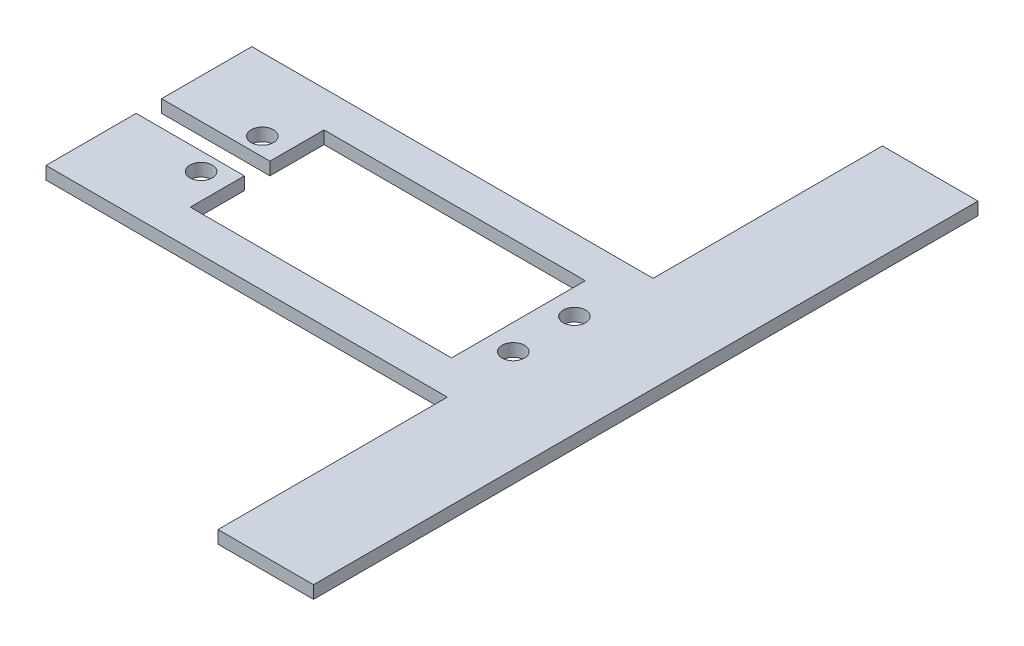
ISO-10303-21;
HEADER;
FILE_DESCRIPTION(('STEP AP214'),'2;1');
FILE_NAME('part.step','',(''),(''),'','','');
FILE_SCHEMA(('AUTOMOTIVE_DESIGN { 1 0 10303 214 1 1 1 1 }'));
ENDSEC;
DATA;
#1=APPLICATION_CONTEXT('core data for automotive mechanical design processes');
#2=APPLICATION_PROTOCOL_DEFINITION('international standard','automotive_design',2000,#1);
#3=PRODUCT_CONTEXT('',#1,'mechanical');
#4=PRODUCT('Part','Part','',(#3));
#5=PRODUCT_RELATED_PRODUCT_CATEGORY('part','',(#4));
#6=PRODUCT_DEFINITION_FORMATION('','',#4);
#7=PRODUCT_DEFINITION_CONTEXT('part definition',#1,'design');
#8=PRODUCT_DEFINITION('design','',#6,#7);
#9=PRODUCT_DEFINITION_SHAPE('','',#8);
#10=(LENGTH_UNIT() NAMED_UNIT(*) SI_UNIT(.MILLI.,.METRE.));
#11=(NAMED_UNIT(*) PLANE_ANGLE_UNIT() SI_UNIT($,.RADIAN.));
#12=(NAMED_UNIT(*) SI_UNIT($,.STERADIAN.) SOLID_ANGLE_UNIT());
#13=UNCERTAINTY_MEASURE_WITH_UNIT(LENGTH_MEASURE(1.E-05),#10,'distance_accuracy_value','');
#14=(GEOMETRIC_REPRESENTATION_CONTEXT(3) GLOBAL_UNCERTAINTY_ASSIGNED_CONTEXT((#13)) GLOBAL_UNIT_ASSIGNED_CONTEXT((#10,
#11,#12)) REPRESENTATION_CONTEXT('',''));
#15=CARTESIAN_POINT('',(0.,0.,0.));
#16=DIRECTION('',(0.,0.,1.));
#17=DIRECTION('',(1.,0.,0.));
#18=AXIS2_PLACEMENT_3D('',#15,#16,#17);
#19=CARTESIAN_POINT('',(0.,2.,0.));
#20=DIRECTION('',(0.,-1.,0.));
#21=DIRECTION('',(0.,0.,-1.));
#22=AXIS2_PLACEMENT_3D('',#19,#20,#21);
#23=PLANE('',#22);
#24=DIRECTION('',(0.,0.,1.));
#25=VECTOR('',#24,1.);
#26=CARTESIAN_POINT('',(-37.5,2.,-16.15));
#27=LINE('',#26,#25);
#28=CARTESIAN_POINT('',(-37.5,2.,-16.15));
#29=VERTEX_POINT('',#28);
#30=CARTESIAN_POINT('',(-37.5,2.,-2.));
#31=VERTEX_POINT('',#30);
#32=EDGE_CURVE('E209',#29,#31,#27,.T.);
#33=ORIENTED_EDGE('',*,*,#32,.T.);
#34=DIRECTION('',(1.,0.,0.));
#35=VECTOR('',#34,1.);
#36=CARTESIAN_POINT('',(-20.5,2.,-2.));
#37=LINE('',#36,#35);
#38=CARTESIAN_POINT('',(-20.5,2.,-2.));
#39=VERTEX_POINT('',#38);
#40=EDGE_CURVE('E117',#31,#39,#37,.T.);
#41=ORIENTED_EDGE('',*,*,#40,.T.);
#42=DIRECTION('',(0.,0.,-1.));
#43=VECTOR('',#42,1.);
#44=CARTESIAN_POINT('',(-20.5,2.,-10.5));
#45=LINE('',#44,#43);
#46=CARTESIAN_POINT('',(-20.5,2.,-10.5));
#47=VERTEX_POINT('',#46);
#48=EDGE_CURVE('E248',#39,#47,#45,.T.);
#49=ORIENTED_EDGE('',*,*,#48,.T.);
#50=DIRECTION('',(1.,0.,0.));
#51=VECTOR('',#50,1.);
#52=CARTESIAN_POINT('',(-20.5,2.,-10.5));
#53=LINE('',#52,#51);
#54=CARTESIAN_POINT('',(20.5,2.,-10.5));
#55=VERTEX_POINT('',#54);
#56=EDGE_CURVE('E267',#47,#55,#53,.T.);
#57=ORIENTED_EDGE('',*,*,#56,.T.);
#58=DIRECTION('',(0.,0.,1.));
#59=VECTOR('',#58,1.);
#60=CARTESIAN_POINT('',(20.5,2.,-10.5));
#61=LINE('',#60,#59);
#62=CARTESIAN_POINT('',(20.5,2.,10.5));
#63=VERTEX_POINT('',#62);
#64=EDGE_CURVE('E264',#55,#63,#61,.T.);
#65=ORIENTED_EDGE('',*,*,#64,.T.);
#66=DIRECTION('',(-1.,0.,0.));
#67=VECTOR('',#66,1.);
#68=CARTESIAN_POINT('',(-20.5,2.,10.5));
#69=LINE('',#68,#67);
#70=CARTESIAN_POINT('',(-20.5,2.,10.5));
#71=VERTEX_POINT('',#70);
#72=EDGE_CURVE('E266',#63,#71,#69,.T.);
#73=ORIENTED_EDGE('',*,*,#72,.T.);
#74=DIRECTION('',(0.,0.,-1.));
#75=VECTOR('',#74,1.);
#76=CARTESIAN_POINT('',(-20.5,2.,2.));
#77=LINE('',#76,#75);
#78=CARTESIAN_POINT('',(-20.5,2.,2.));
#79=VERTEX_POINT('',#78);
#80=EDGE_CURVE('E269',#71,#79,#77,.T.);
#81=ORIENTED_EDGE('',*,*,#80,.T.);
#82=DIRECTION('',(-1.,0.,0.));
#83=VECTOR('',#82,1.);
#84=CARTESIAN_POINT('',(-20.5,2.,2.));
#85=LINE('',#84,#83);
#86=CARTESIAN_POINT('',(-37.5,2.,2.));
#87=VERTEX_POINT('',#86);
#88=EDGE_CURVE('E275',#79,#87,#85,.T.);
#89=ORIENTED_EDGE('',*,*,#88,.T.);
#90=DIRECTION('',(0.,0.,1.));
#91=VECTOR('',#90,1.);
#92=CARTESIAN_POINT('',(-37.5,2.,2.));
#93=LINE('',#92,#91);
#94=CARTESIAN_POINT('',(-37.5,2.,16.15));
#95=VERTEX_POINT('',#94);
#96=EDGE_CURVE('E277',#87,#95,#93,.T.);
#97=ORIENTED_EDGE('',*,*,#96,.T.);
#98=DIRECTION('',(1.,0.,0.));
#99=VECTOR('',#98,1.);
#100=CARTESIAN_POINT('',(-37.5,2.,16.15));
#101=LINE('',#100,#99);
#102=CARTESIAN_POINT('',(25.5,2.,16.15));
#103=VERTEX_POINT('',#102);
#104=EDGE_CURVE('E279',#95,#103,#101,.T.);
#105=ORIENTED_EDGE('',*,*,#104,.T.);
#106=DIRECTION('',(0.,0.,1.));
#107=VECTOR('',#106,1.);
#108=CARTESIAN_POINT('',(25.5,2.,16.15));
#109=LINE('',#108,#107);
#110=CARTESIAN_POINT('',(25.5,2.,52.15));
#111=VERTEX_POINT('',#110);
#112=EDGE_CURVE('E281',#103,#111,#109,.T.);
#113=ORIENTED_EDGE('',*,*,#112,.T.);
#114=DIRECTION('',(1.,0.,0.));
#115=VECTOR('',#114,1.);
#116=CARTESIAN_POINT('',(25.5,2.,52.15));
#117=LINE('',#116,#115);
#118=CARTESIAN_POINT('',(40.5,2.,52.15));
#119=VERTEX_POINT('',#118);
#120=EDGE_CURVE('E283',#111,#119,#117,.T.);
#121=ORIENTED_EDGE('',*,*,#120,.T.);
#122=DIRECTION('',(0.,0.,-1.));
#123=VECTOR('',#122,1.);
#124=CARTESIAN_POINT('',(40.5,2.,-52.15));
#125=LINE('',#124,#123);
#126=CARTESIAN_POINT('',(40.5,2.,-52.15));
#127=VERTEX_POINT('',#126);
#128=EDGE_CURVE('E160',#119,#127,#125,.T.);
#129=ORIENTED_EDGE('',*,*,#128,.T.);
#130=DIRECTION('',(-1.,0.,0.));
#131=VECTOR('',#130,1.);
#132=CARTESIAN_POINT('',(25.5,2.,-52.15));
#133=LINE('',#132,#131);
#134=CARTESIAN_POINT('',(25.5,2.,-52.15));
#135=VERTEX_POINT('',#134);
#136=EDGE_CURVE('E154',#127,#135,#133,.T.);
#137=ORIENTED_EDGE('',*,*,#136,.T.);
#138=DIRECTION('',(0.,0.,1.));
#139=VECTOR('',#138,1.);
#140=CARTESIAN_POINT('',(25.5,2.,-52.15));
#141=LINE('',#140,#139);
#142=CARTESIAN_POINT('',(25.5,2.,-16.15));
#143=VERTEX_POINT('',#142);
#144=EDGE_CURVE('E158',#135,#143,#141,.T.);
#145=ORIENTED_EDGE('',*,*,#144,.T.);
#146=DIRECTION('',(-1.,0.,0.));
#147=VECTOR('',#146,1.);
#148=CARTESIAN_POINT('',(-37.5,2.,-16.15));
#149=LINE('',#148,#147);
#150=EDGE_CURVE('E50',#143,#29,#149,.T.);
#151=ORIENTED_EDGE('',*,*,#150,.T.);
#152=EDGE_LOOP('',(#33,#41,#49,#57,#65,#73,#81,#89,#97,#105,#113,#121,#129,#137,#145,#151));
#153=FACE_BOUND('',#152,.T.);
#154=CARTESIAN_POINT('',(-24.5,2.,-4.8));
#155=DIRECTION('',(0.,1.,0.));
#156=DIRECTION('',(0.,0.,1.));
#157=AXIS2_PLACEMENT_3D('',#154,#155,#156);
#158=CIRCLE('',#157,1.75);
#159=CARTESIAN_POINT('',(-24.5,2.,-3.05));
#160=VERTEX_POINT('',#159);
#161=EDGE_CURVE('E182',#160,#160,#158,.T.);
#162=ORIENTED_EDGE('',*,*,#161,.F.);
#163=EDGE_LOOP('',(#162));
#164=FACE_BOUND('',#163,.T.);
#165=CARTESIAN_POINT('',(-24.5,2.,4.8));
#166=DIRECTION('',(0.,1.,0.));
#167=DIRECTION('',(0.,0.,1.));
#168=AXIS2_PLACEMENT_3D('',#165,#166,#167);
#169=CIRCLE('',#168,1.75);
#170=CARTESIAN_POINT('',(-24.5,2.,6.55));
#171=VERTEX_POINT('',#170);
#172=EDGE_CURVE('E347',#171,#171,#169,.T.);
#173=ORIENTED_EDGE('',*,*,#172,.F.);
#174=EDGE_LOOP('',(#173));
#175=FACE_BOUND('',#174,.T.);
#176=CARTESIAN_POINT('',(24.5,2.,4.79999999999999));
#177=DIRECTION('',(0.,1.,0.));
#178=DIRECTION('',(0.,0.,-1.));
#179=AXIS2_PLACEMENT_3D('',#176,#177,#178);
#180=CIRCLE('',#179,1.75000000000001);
#181=CARTESIAN_POINT('',(24.5,2.,3.04999999999998));
#182=VERTEX_POINT('',#181);
#183=EDGE_CURVE('E341',#182,#182,#180,.T.);
#184=ORIENTED_EDGE('',*,*,#183,.F.);
#185=EDGE_LOOP('',(#184));
#186=FACE_BOUND('',#185,.T.);
#187=CARTESIAN_POINT('',(24.5,2.,-4.80000000000001));
#188=DIRECTION('',(0.,1.,0.));
#189=DIRECTION('',(0.,0.,-1.));
#190=AXIS2_PLACEMENT_3D('',#187,#188,#189);
#191=CIRCLE('',#190,1.75);
#192=CARTESIAN_POINT('',(24.5,2.,-6.55000000000001));
#193=VERTEX_POINT('',#192);
#194=EDGE_CURVE('E332',#193,#193,#191,.T.);
#195=ORIENTED_EDGE('',*,*,#194,.F.);
#196=EDGE_LOOP('',(#195));
#197=FACE_BOUND('',#196,.T.);
#198=ADVANCED_FACE('F33',(#153,#164,#175,#186,#197),#23,.F.);
#199=CARTESIAN_POINT('',(0.,0.,0.));
#200=DIRECTION('',(0.,-1.,0.));
#201=DIRECTION('',(0.,0.,-1.));
#202=AXIS2_PLACEMENT_3D('',#199,#200,#201);
#203=PLANE('',#202);
#204=CARTESIAN_POINT('',(24.5,0.,4.79999999999999));
#205=DIRECTION('',(0.,1.,0.));
#206=DIRECTION('',(0.,0.,-1.));
#207=AXIS2_PLACEMENT_3D('',#204,#205,#206);
#208=CIRCLE('',#207,1.75000000000001);
#209=CARTESIAN_POINT('',(24.5,0.,3.04999999999998));
#210=VERTEX_POINT('',#209);
#211=EDGE_CURVE('E338',#210,#210,#208,.T.);
#212=ORIENTED_EDGE('',*,*,#211,.T.);
#213=EDGE_LOOP('',(#212));
#214=FACE_BOUND('',#213,.T.);
#215=CARTESIAN_POINT('',(-24.5,0.,-4.8));
#216=DIRECTION('',(0.,1.,0.));
#217=DIRECTION('',(0.,0.,1.));
#218=AXIS2_PLACEMENT_3D('',#215,#216,#217);
#219=CIRCLE('',#218,1.75);
#220=CARTESIAN_POINT('',(-24.5,0.,-3.05));
#221=VERTEX_POINT('',#220);
#222=EDGE_CURVE('E350',#221,#221,#219,.T.);
#223=ORIENTED_EDGE('',*,*,#222,.T.);
#224=EDGE_LOOP('',(#223));
#225=FACE_BOUND('',#224,.T.);
#226=DIRECTION('',(0.,0.,1.));
#227=VECTOR('',#226,1.);
#228=CARTESIAN_POINT('',(-37.5,0.,-16.15));
#229=LINE('',#228,#227);
#230=CARTESIAN_POINT('',(-37.5,0.,-16.15));
#231=VERTEX_POINT('',#230);
#232=CARTESIAN_POINT('',(-37.5,0.,-2.));
#233=VERTEX_POINT('',#232);
#234=EDGE_CURVE('E178',#231,#233,#229,.T.);
#235=ORIENTED_EDGE('',*,*,#234,.F.);
#236=DIRECTION('',(-1.,0.,0.));
#237=VECTOR('',#236,1.);
#238=CARTESIAN_POINT('',(-37.5,0.,-16.15));
#239=LINE('',#238,#237);
#240=CARTESIAN_POINT('',(25.5,0.,-16.15));
#241=VERTEX_POINT('',#240);
#242=EDGE_CURVE('E109',#241,#231,#239,.T.);
#243=ORIENTED_EDGE('',*,*,#242,.F.);
#244=DIRECTION('',(0.,0.,1.));
#245=VECTOR('',#244,1.);
#246=CARTESIAN_POINT('',(25.5,0.,-52.15));
#247=LINE('',#246,#245);
#248=CARTESIAN_POINT('',(25.5,0.,-52.15));
#249=VERTEX_POINT('',#248);
#250=EDGE_CURVE('E103',#249,#241,#247,.T.);
#251=ORIENTED_EDGE('',*,*,#250,.F.);
#252=DIRECTION('',(-1.,0.,0.));
#253=VECTOR('',#252,1.);
#254=CARTESIAN_POINT('',(25.5,0.,-52.15));
#255=LINE('',#254,#253);
#256=CARTESIAN_POINT('',(40.5,0.,-52.15));
#257=VERTEX_POINT('',#256);
#258=EDGE_CURVE('E168',#257,#249,#255,.T.);
#259=ORIENTED_EDGE('',*,*,#258,.F.);
#260=DIRECTION('',(0.,0.,-1.));
#261=VECTOR('',#260,1.);
#262=CARTESIAN_POINT('',(40.5,0.,-52.15));
#263=LINE('',#262,#261);
#264=CARTESIAN_POINT('',(40.5,0.,52.15));
#265=VERTEX_POINT('',#264);
#266=EDGE_CURVE('E204',#265,#257,#263,.T.);
#267=ORIENTED_EDGE('',*,*,#266,.F.);
#268=DIRECTION('',(1.,0.,0.));
#269=VECTOR('',#268,1.);
#270=CARTESIAN_POINT('',(25.5,0.,52.15));
#271=LINE('',#270,#269);
#272=CARTESIAN_POINT('',(25.5,0.,52.15));
#273=VERTEX_POINT('',#272);
#274=EDGE_CURVE('E202',#273,#265,#271,.T.);
#275=ORIENTED_EDGE('',*,*,#274,.F.);
#276=DIRECTION('',(0.,0.,1.));
#277=VECTOR('',#276,1.);
#278=CARTESIAN_POINT('',(25.5,0.,16.15));
#279=LINE('',#278,#277);
#280=CARTESIAN_POINT('',(25.5,0.,16.15));
#281=VERTEX_POINT('',#280);
#282=EDGE_CURVE('E200',#281,#273,#279,.T.);
#283=ORIENTED_EDGE('',*,*,#282,.F.);
#284=DIRECTION('',(1.,0.,0.));
#285=VECTOR('',#284,1.);
#286=CARTESIAN_POINT('',(-37.5,0.,16.15));
#287=LINE('',#286,#285);
#288=CARTESIAN_POINT('',(-37.5,0.,16.15));
#289=VERTEX_POINT('',#288);
#290=EDGE_CURVE('E198',#289,#281,#287,.T.);
#291=ORIENTED_EDGE('',*,*,#290,.F.);
#292=DIRECTION('',(0.,0.,1.));
#293=VECTOR('',#292,1.);
#294=CARTESIAN_POINT('',(-37.5,0.,2.));
#295=LINE('',#294,#293);
#296=CARTESIAN_POINT('',(-37.5,0.,2.));
#297=VERTEX_POINT('',#296);
#298=EDGE_CURVE('E196',#297,#289,#295,.T.);
#299=ORIENTED_EDGE('',*,*,#298,.F.);
#300=DIRECTION('',(-1.,0.,0.));
#301=VECTOR('',#300,1.);
#302=CARTESIAN_POINT('',(-20.5,0.,2.));
#303=LINE('',#302,#301);
#304=CARTESIAN_POINT('',(-20.5,0.,2.));
#305=VERTEX_POINT('',#304);
#306=EDGE_CURVE('E194',#305,#297,#303,.T.);
#307=ORIENTED_EDGE('',*,*,#306,.F.);
#308=DIRECTION('',(0.,0.,-1.));
#309=VECTOR('',#308,1.);
#310=CARTESIAN_POINT('',(-20.5,0.,2.));
#311=LINE('',#310,#309);
#312=CARTESIAN_POINT('',(-20.5,0.,10.5));
#313=VERTEX_POINT('',#312);
#314=EDGE_CURVE('E192',#313,#305,#311,.T.);
#315=ORIENTED_EDGE('',*,*,#314,.F.);
#316=DIRECTION('',(-1.,0.,0.));
#317=VECTOR('',#316,1.);
#318=CARTESIAN_POINT('',(-20.5,0.,10.5));
#319=LINE('',#318,#317);
#320=CARTESIAN_POINT('',(20.5,0.,10.5));
#321=VERTEX_POINT('',#320);
#322=EDGE_CURVE('E190',#321,#313,#319,.T.);
#323=ORIENTED_EDGE('',*,*,#322,.F.);
#324=DIRECTION('',(0.,0.,1.));
#325=VECTOR('',#324,1.);
#326=CARTESIAN_POINT('',(20.5,0.,-10.5));
#327=LINE('',#326,#325);
#328=CARTESIAN_POINT('',(20.5,0.,-10.5));
#329=VERTEX_POINT('',#328);
#330=EDGE_CURVE('E188',#329,#321,#327,.T.);
#331=ORIENTED_EDGE('',*,*,#330,.F.);
#332=DIRECTION('',(1.,0.,0.));
#333=VECTOR('',#332,1.);
#334=CARTESIAN_POINT('',(-20.5,0.,-10.5));
#335=LINE('',#334,#333);
#336=CARTESIAN_POINT('',(-20.5,0.,-10.5));
#337=VERTEX_POINT('',#336);
#338=EDGE_CURVE('E186',#337,#329,#335,.T.);
#339=ORIENTED_EDGE('',*,*,#338,.F.);
#340=DIRECTION('',(0.,0.,-1.));
#341=VECTOR('',#340,1.);
#342=CARTESIAN_POINT('',(-20.5,0.,-10.5));
#343=LINE('',#342,#341);
#344=CARTESIAN_POINT('',(-20.5,0.,-2.));
#345=VERTEX_POINT('',#344);
#346=EDGE_CURVE('E184',#345,#337,#343,.T.);
#347=ORIENTED_EDGE('',*,*,#346,.F.);
#348=DIRECTION('',(1.,0.,0.));
#349=VECTOR('',#348,1.);
#350=CARTESIAN_POINT('',(-20.5,0.,-2.));
#351=LINE('',#350,#349);
#352=EDGE_CURVE('E181',#233,#345,#351,.T.);
#353=ORIENTED_EDGE('',*,*,#352,.F.);
#354=EDGE_LOOP('',(#235,#243,#251,#259,#267,#275,#283,#291,#299,#307,#315,#323,#331,#339,#347,#353));
#355=FACE_BOUND('',#354,.T.);
#356=CARTESIAN_POINT('',(-24.5,0.,4.8));
#357=DIRECTION('',(0.,1.,0.));
#358=DIRECTION('',(0.,0.,1.));
#359=AXIS2_PLACEMENT_3D('',#356,#357,#358);
#360=CIRCLE('',#359,1.75);
#361=CARTESIAN_POINT('',(-24.5,0.,6.55));
#362=VERTEX_POINT('',#361);
#363=EDGE_CURVE('E344',#362,#362,#360,.T.);
#364=ORIENTED_EDGE('',*,*,#363,.T.);
#365=EDGE_LOOP('',(#364));
#366=FACE_BOUND('',#365,.T.);
#367=CARTESIAN_POINT('',(24.5,0.,-4.80000000000001));
#368=DIRECTION('',(0.,1.,0.));
#369=DIRECTION('',(0.,0.,-1.));
#370=AXIS2_PLACEMENT_3D('',#367,#368,#369);
#371=CIRCLE('',#370,1.75);
#372=CARTESIAN_POINT('',(24.5,0.,-6.55000000000001));
#373=VERTEX_POINT('',#372);
#374=EDGE_CURVE('E335',#373,#373,#371,.T.);
#375=ORIENTED_EDGE('',*,*,#374,.T.);
#376=EDGE_LOOP('',(#375));
#377=FACE_BOUND('',#376,.T.);
#378=ADVANCED_FACE('F252',(#214,#225,#355,#366,#377),#203,.T.);
#379=CARTESIAN_POINT('',(-37.5,2.,-16.15));
#380=DIRECTION('',(1.,0.,0.));
#381=DIRECTION('',(0.,0.,-1.));
#382=AXIS2_PLACEMENT_3D('',#379,#380,#381);
#383=PLANE('',#382);
#384=ORIENTED_EDGE('',*,*,#234,.T.);
#385=DIRECTION('',(0.,-1.,0.));
#386=VECTOR('',#385,1.);
#387=CARTESIAN_POINT('',(-37.5,2.,-2.));
#388=LINE('',#387,#386);
#389=EDGE_CURVE('E11',#31,#233,#388,.T.);
#390=ORIENTED_EDGE('',*,*,#389,.F.);
#391=ORIENTED_EDGE('',*,*,#32,.F.);
#392=DIRECTION('',(0.,-1.,0.));
#393=VECTOR('',#392,1.);
#394=CARTESIAN_POINT('',(-37.5,2.,-16.15));
#395=LINE('',#394,#393);
#396=EDGE_CURVE('E174',#29,#231,#395,.T.);
#397=ORIENTED_EDGE('',*,*,#396,.T.);
#398=EDGE_LOOP('',(#384,#390,#391,#397));
#399=FACE_BOUND('',#398,.T.);
#400=ADVANCED_FACE('F35',(#399),#383,.F.);
#401=CARTESIAN_POINT('',(-20.5,2.,-2.));
#402=DIRECTION('',(0.,0.,-1.));
#403=DIRECTION('',(-1.,0.,0.));
#404=AXIS2_PLACEMENT_3D('',#401,#402,#403);
#405=PLANE('',#404);
#406=ORIENTED_EDGE('',*,*,#352,.T.);
#407=DIRECTION('',(0.,-1.,0.));
#408=VECTOR('',#407,1.);
#409=CARTESIAN_POINT('',(-20.5,2.,-2.));
#410=LINE('',#409,#408);
#411=EDGE_CURVE('E42',#39,#345,#410,.T.);
#412=ORIENTED_EDGE('',*,*,#411,.F.);
#413=ORIENTED_EDGE('',*,*,#40,.F.);
#414=ORIENTED_EDGE('',*,*,#389,.T.);
#415=EDGE_LOOP('',(#406,#412,#413,#414));
#416=FACE_BOUND('',#415,.T.);
#417=ADVANCED_FACE('F502',(#416),#405,.F.);
#418=CARTESIAN_POINT('',(-20.5,2.,-10.5));
#419=DIRECTION('',(-1.,0.,0.));
#420=DIRECTION('',(0.,0.,1.));
#421=AXIS2_PLACEMENT_3D('',#418,#419,#420);
#422=PLANE('',#421);
#423=ORIENTED_EDGE('',*,*,#346,.T.);
#424=DIRECTION('',(0.,-1.,0.));
#425=VECTOR('',#424,1.);
#426=CARTESIAN_POINT('',(-20.5,2.,-10.5));
#427=LINE('',#426,#425);
#428=EDGE_CURVE('E240',#47,#337,#427,.T.);
#429=ORIENTED_EDGE('',*,*,#428,.F.);
#430=ORIENTED_EDGE('',*,*,#48,.F.);
#431=ORIENTED_EDGE('',*,*,#411,.T.);
#432=EDGE_LOOP('',(#423,#429,#430,#431));
#433=FACE_BOUND('',#432,.T.);
#434=ADVANCED_FACE('F246',(#433),#422,.F.);
#435=CARTESIAN_POINT('',(-20.5,2.,-10.5));
#436=DIRECTION('',(0.,0.,-1.));
#437=DIRECTION('',(-1.,0.,0.));
#438=AXIS2_PLACEMENT_3D('',#435,#436,#437);
#439=PLANE('',#438);
#440=ORIENTED_EDGE('',*,*,#338,.T.);
#441=DIRECTION('',(0.,-1.,0.));
#442=VECTOR('',#441,1.);
#443=CARTESIAN_POINT('',(20.5,2.,-10.5));
#444=LINE('',#443,#442);
#445=EDGE_CURVE('E237',#55,#329,#444,.T.);
#446=ORIENTED_EDGE('',*,*,#445,.F.);
#447=ORIENTED_EDGE('',*,*,#56,.F.);
#448=ORIENTED_EDGE('',*,*,#428,.T.);
#449=EDGE_LOOP('',(#440,#446,#447,#448));
#450=FACE_BOUND('',#449,.T.);
#451=ADVANCED_FACE('F258',(#450),#439,.F.);
#452=CARTESIAN_POINT('',(20.5,2.,-10.5));
#453=DIRECTION('',(1.,0.,0.));
#454=DIRECTION('',(0.,0.,-1.));
#455=AXIS2_PLACEMENT_3D('',#452,#453,#454);
#456=PLANE('',#455);
#457=ORIENTED_EDGE('',*,*,#330,.T.);
#458=DIRECTION('',(0.,-1.,0.));
#459=VECTOR('',#458,1.);
#460=CARTESIAN_POINT('',(20.5,2.,10.5));
#461=LINE('',#460,#459);
#462=EDGE_CURVE('E234',#63,#321,#461,.T.);
#463=ORIENTED_EDGE('',*,*,#462,.F.);
#464=ORIENTED_EDGE('',*,*,#64,.F.);
#465=ORIENTED_EDGE('',*,*,#445,.T.);
#466=EDGE_LOOP('',(#457,#463,#464,#465));
#467=FACE_BOUND('',#466,.T.);
#468=ADVANCED_FACE('F262',(#467),#456,.F.);
#469=CARTESIAN_POINT('',(-20.5,2.,10.5));
#470=DIRECTION('',(0.,0.,1.));
#471=DIRECTION('',(1.,0.,0.));
#472=AXIS2_PLACEMENT_3D('',#469,#470,#471);
#473=PLANE('',#472);
#474=ORIENTED_EDGE('',*,*,#322,.T.);
#475=DIRECTION('',(0.,-1.,0.));
#476=VECTOR('',#475,1.);
#477=CARTESIAN_POINT('',(-20.5,2.,10.5));
#478=LINE('',#477,#476);
#479=EDGE_CURVE('E231',#71,#313,#478,.T.);
#480=ORIENTED_EDGE('',*,*,#479,.F.);
#481=ORIENTED_EDGE('',*,*,#72,.F.);
#482=ORIENTED_EDGE('',*,*,#462,.T.);
#483=EDGE_LOOP('',(#474,#480,#481,#482));
#484=FACE_BOUND('',#483,.T.);
#485=ADVANCED_FACE('F467',(#484),#473,.F.);
#486=CARTESIAN_POINT('',(-20.5,2.,2.));
#487=DIRECTION('',(-1.,0.,0.));
#488=DIRECTION('',(0.,0.,1.));
#489=AXIS2_PLACEMENT_3D('',#486,#487,#488);
#490=PLANE('',#489);
#491=ORIENTED_EDGE('',*,*,#314,.T.);
#492=DIRECTION('',(0.,-1.,0.));
#493=VECTOR('',#492,1.);
#494=CARTESIAN_POINT('',(-20.5,2.,2.));
#495=LINE('',#494,#493);
#496=EDGE_CURVE('E228',#79,#305,#495,.T.);
#497=ORIENTED_EDGE('',*,*,#496,.F.);
#498=ORIENTED_EDGE('',*,*,#80,.F.);
#499=ORIENTED_EDGE('',*,*,#479,.T.);
#500=EDGE_LOOP('',(#491,#497,#498,#499));
#501=FACE_BOUND('',#500,.T.);
#502=ADVANCED_FACE('F457',(#501),#490,.F.);
#503=CARTESIAN_POINT('',(-20.5,2.,2.));
#504=DIRECTION('',(0.,0.,1.));
#505=DIRECTION('',(1.,0.,0.));
#506=AXIS2_PLACEMENT_3D('',#503,#504,#505);
#507=PLANE('',#506);
#508=ORIENTED_EDGE('',*,*,#306,.T.);
#509=DIRECTION('',(0.,-1.,0.));
#510=VECTOR('',#509,1.);
#511=CARTESIAN_POINT('',(-37.5,2.,2.));
#512=LINE('',#511,#510);
#513=EDGE_CURVE('E225',#87,#297,#512,.T.);
#514=ORIENTED_EDGE('',*,*,#513,.F.);
#515=ORIENTED_EDGE('',*,*,#88,.F.);
#516=ORIENTED_EDGE('',*,*,#496,.T.);
#517=EDGE_LOOP('',(#508,#514,#515,#516));
#518=FACE_BOUND('',#517,.T.);
#519=ADVANCED_FACE('F447',(#518),#507,.F.);
#520=CARTESIAN_POINT('',(-37.5,2.,2.));
#521=DIRECTION('',(1.,0.,0.));
#522=DIRECTION('',(0.,0.,-1.));
#523=AXIS2_PLACEMENT_3D('',#520,#521,#522);
#524=PLANE('',#523);
#525=ORIENTED_EDGE('',*,*,#298,.T.);
#526=DIRECTION('',(0.,-1.,0.));
#527=VECTOR('',#526,1.);
#528=CARTESIAN_POINT('',(-37.5,2.,16.15));
#529=LINE('',#528,#527);
#530=EDGE_CURVE('E222',#95,#289,#529,.T.);
#531=ORIENTED_EDGE('',*,*,#530,.F.);
#532=ORIENTED_EDGE('',*,*,#96,.F.);
#533=ORIENTED_EDGE('',*,*,#513,.T.);
#534=EDGE_LOOP('',(#525,#531,#532,#533));
#535=FACE_BOUND('',#534,.T.);
#536=ADVANCED_FACE('F437',(#535),#524,.F.);
#537=CARTESIAN_POINT('',(-37.5,2.,16.15));
#538=DIRECTION('',(0.,0.,-1.));
#539=DIRECTION('',(-1.,0.,0.));
#540=AXIS2_PLACEMENT_3D('',#537,#538,#539);
#541=PLANE('',#540);
#542=ORIENTED_EDGE('',*,*,#290,.T.);
#543=DIRECTION('',(0.,-1.,0.));
#544=VECTOR('',#543,1.);
#545=CARTESIAN_POINT('',(25.5,2.,16.15));
#546=LINE('',#545,#544);
#547=EDGE_CURVE('E219',#103,#281,#546,.T.);
#548=ORIENTED_EDGE('',*,*,#547,.F.);
#549=ORIENTED_EDGE('',*,*,#104,.F.);
#550=ORIENTED_EDGE('',*,*,#530,.T.);
#551=EDGE_LOOP('',(#542,#548,#549,#550));
#552=FACE_BOUND('',#551,.T.);
#553=ADVANCED_FACE('F427',(#552),#541,.F.);
#554=CARTESIAN_POINT('',(25.5,2.,16.15));
#555=DIRECTION('',(1.,0.,0.));
#556=DIRECTION('',(0.,0.,-1.));
#557=AXIS2_PLACEMENT_3D('',#554,#555,#556);
#558=PLANE('',#557);
#559=ORIENTED_EDGE('',*,*,#282,.T.);
#560=DIRECTION('',(0.,-1.,0.));
#561=VECTOR('',#560,1.);
#562=CARTESIAN_POINT('',(25.5,2.,52.15));
#563=LINE('',#562,#561);
#564=EDGE_CURVE('E216',#111,#273,#563,.T.);
#565=ORIENTED_EDGE('',*,*,#564,.F.);
#566=ORIENTED_EDGE('',*,*,#112,.F.);
#567=ORIENTED_EDGE('',*,*,#547,.T.);
#568=EDGE_LOOP('',(#559,#565,#566,#567));
#569=FACE_BOUND('',#568,.T.);
#570=ADVANCED_FACE('F418',(#569),#558,.F.);
#571=CARTESIAN_POINT('',(25.5,2.,52.15));
#572=DIRECTION('',(0.,0.,-1.));
#573=DIRECTION('',(-1.,0.,0.));
#574=AXIS2_PLACEMENT_3D('',#571,#572,#573);
#575=PLANE('',#574);
#576=ORIENTED_EDGE('',*,*,#274,.T.);
#577=DIRECTION('',(0.,-1.,0.));
#578=VECTOR('',#577,1.);
#579=CARTESIAN_POINT('',(40.5,2.,52.15));
#580=LINE('',#579,#578);
#581=EDGE_CURVE('E213',#119,#265,#580,.T.);
#582=ORIENTED_EDGE('',*,*,#581,.F.);
#583=ORIENTED_EDGE('',*,*,#120,.F.);
#584=ORIENTED_EDGE('',*,*,#564,.T.);
#585=EDGE_LOOP('',(#576,#582,#583,#584));
#586=FACE_BOUND('',#585,.T.);
#587=ADVANCED_FACE('F289',(#586),#575,.F.);
#588=CARTESIAN_POINT('',(40.5,2.,-52.15));
#589=DIRECTION('',(-1.,0.,0.));
#590=DIRECTION('',(0.,0.,1.));
#591=AXIS2_PLACEMENT_3D('',#588,#589,#590);
#592=PLANE('',#591);
#593=ORIENTED_EDGE('',*,*,#266,.T.);
#594=DIRECTION('',(0.,-1.,0.));
#595=VECTOR('',#594,1.);
#596=CARTESIAN_POINT('',(40.5,2.,-52.15));
#597=LINE('',#596,#595);
#598=EDGE_CURVE('E169',#127,#257,#597,.T.);
#599=ORIENTED_EDGE('',*,*,#598,.F.);
#600=ORIENTED_EDGE('',*,*,#128,.F.);
#601=ORIENTED_EDGE('',*,*,#581,.T.);
#602=EDGE_LOOP('',(#593,#599,#600,#601));
#603=FACE_BOUND('',#602,.T.);
#604=ADVANCED_FACE('F293',(#603),#592,.F.);
#605=CARTESIAN_POINT('',(25.5,2.,-52.15));
#606=DIRECTION('',(0.,0.,1.));
#607=DIRECTION('',(1.,0.,0.));
#608=AXIS2_PLACEMENT_3D('',#605,#606,#607);
#609=PLANE('',#608);
#610=ORIENTED_EDGE('',*,*,#258,.T.);
#611=DIRECTION('',(0.,-1.,0.));
#612=VECTOR('',#611,1.);
#613=CARTESIAN_POINT('',(25.5,2.,-52.15));
#614=LINE('',#613,#612);
#615=EDGE_CURVE('E165',#135,#249,#614,.T.);
#616=ORIENTED_EDGE('',*,*,#615,.F.);
#617=ORIENTED_EDGE('',*,*,#136,.F.);
#618=ORIENTED_EDGE('',*,*,#598,.T.);
#619=EDGE_LOOP('',(#610,#616,#617,#618));
#620=FACE_BOUND('',#619,.T.);
#621=ADVANCED_FACE('F166',(#620),#609,.F.);
#622=CARTESIAN_POINT('',(25.5,2.,-52.15));
#623=DIRECTION('',(1.,0.,0.));
#624=DIRECTION('',(0.,0.,-1.));
#625=AXIS2_PLACEMENT_3D('',#622,#623,#624);
#626=PLANE('',#625);
#627=ORIENTED_EDGE('',*,*,#250,.T.);
#628=DIRECTION('',(0.,-1.,0.));
#629=VECTOR('',#628,1.);
#630=CARTESIAN_POINT('',(25.5,2.,-16.15));
#631=LINE('',#630,#629);
#632=EDGE_CURVE('E170',#143,#241,#631,.T.);
#633=ORIENTED_EDGE('',*,*,#632,.F.);
#634=ORIENTED_EDGE('',*,*,#144,.F.);
#635=ORIENTED_EDGE('',*,*,#615,.T.);
#636=EDGE_LOOP('',(#627,#633,#634,#635));
#637=FACE_BOUND('',#636,.T.);
#638=ADVANCED_FACE('F172',(#637),#626,.F.);
#639=CARTESIAN_POINT('',(-37.5,2.,-16.15));
#640=DIRECTION('',(0.,0.,1.));
#641=DIRECTION('',(1.,0.,0.));
#642=AXIS2_PLACEMENT_3D('',#639,#640,#641);
#643=PLANE('',#642);
#644=ORIENTED_EDGE('',*,*,#242,.T.);
#645=ORIENTED_EDGE('',*,*,#396,.F.);
#646=ORIENTED_EDGE('',*,*,#150,.F.);
#647=ORIENTED_EDGE('',*,*,#632,.T.);
#648=EDGE_LOOP('',(#644,#645,#646,#647));
#649=FACE_BOUND('',#648,.T.);
#650=ADVANCED_FACE('F297',(#649),#643,.F.);
#651=CARTESIAN_POINT('',(-24.5,2.,-4.8));
#652=DIRECTION('',(0.,-1.,0.));
#653=DIRECTION('',(0.,0.,-1.));
#654=AXIS2_PLACEMENT_3D('',#651,#652,#653);
#655=CYLINDRICAL_SURFACE('',#654,1.75);
#656=ORIENTED_EDGE('',*,*,#161,.T.);
#657=EDGE_LOOP('',(#656));
#658=FACE_BOUND('',#657,.T.);
#659=ORIENTED_EDGE('',*,*,#222,.F.);
#660=EDGE_LOOP('',(#659));
#661=FACE_BOUND('',#660,.T.);
#662=ADVANCED_FACE('F299',(#658,#661),#655,.F.);
#663=CARTESIAN_POINT('',(-24.5,2.,4.8));
#664=DIRECTION('',(0.,-1.,0.));
#665=DIRECTION('',(0.,0.,-1.));
#666=AXIS2_PLACEMENT_3D('',#663,#664,#665);
#667=CYLINDRICAL_SURFACE('',#666,1.75);
#668=ORIENTED_EDGE('',*,*,#172,.T.);
#669=EDGE_LOOP('',(#668));
#670=FACE_BOUND('',#669,.T.);
#671=ORIENTED_EDGE('',*,*,#363,.F.);
#672=EDGE_LOOP('',(#671));
#673=FACE_BOUND('',#672,.T.);
#674=ADVANCED_FACE('F305',(#670,#673),#667,.F.);
#675=CARTESIAN_POINT('',(24.5,2.,4.79999999999999));
#676=DIRECTION('',(0.,-1.,0.));
#677=DIRECTION('',(0.,0.,-1.));
#678=AXIS2_PLACEMENT_3D('',#675,#676,#677);
#679=CYLINDRICAL_SURFACE('',#678,1.75000000000001);
#680=ORIENTED_EDGE('',*,*,#183,.T.);
#681=EDGE_LOOP('',(#680));
#682=FACE_BOUND('',#681,.T.);
#683=ORIENTED_EDGE('',*,*,#211,.F.);
#684=EDGE_LOOP('',(#683));
#685=FACE_BOUND('',#684,.T.);
#686=ADVANCED_FACE('F319',(#682,#685),#679,.F.);
#687=CARTESIAN_POINT('',(24.5,2.,-4.80000000000001));
#688=DIRECTION('',(0.,-1.,0.));
#689=DIRECTION('',(0.,0.,-1.));
#690=AXIS2_PLACEMENT_3D('',#687,#688,#689);
#691=CYLINDRICAL_SURFACE('',#690,1.75);
#692=ORIENTED_EDGE('',*,*,#194,.T.);
#693=EDGE_LOOP('',(#692));
#694=FACE_BOUND('',#693,.T.);
#695=ORIENTED_EDGE('',*,*,#374,.F.);
#696=EDGE_LOOP('',(#695));
#697=FACE_BOUND('',#696,.T.);
#698=ADVANCED_FACE('F323',(#694,#697),#691,.F.);
#699=CLOSED_SHELL('',(#198,#378,#400,#417,#434,#451,#468,#485,#502,#519,#536,#553,#570,#587,
#604,#621,#638,#650,#662,#674,#686,#698));
#700=MANIFOLD_SOLID_BREP('B2',#699);
#701=ADVANCED_BREP_SHAPE_REPRESENTATION('',(#18,#700),#14);
#702=SHAPE_DEFINITION_REPRESENTATION(#9,#701);
ENDSEC;
END-ISO-10303-21;
